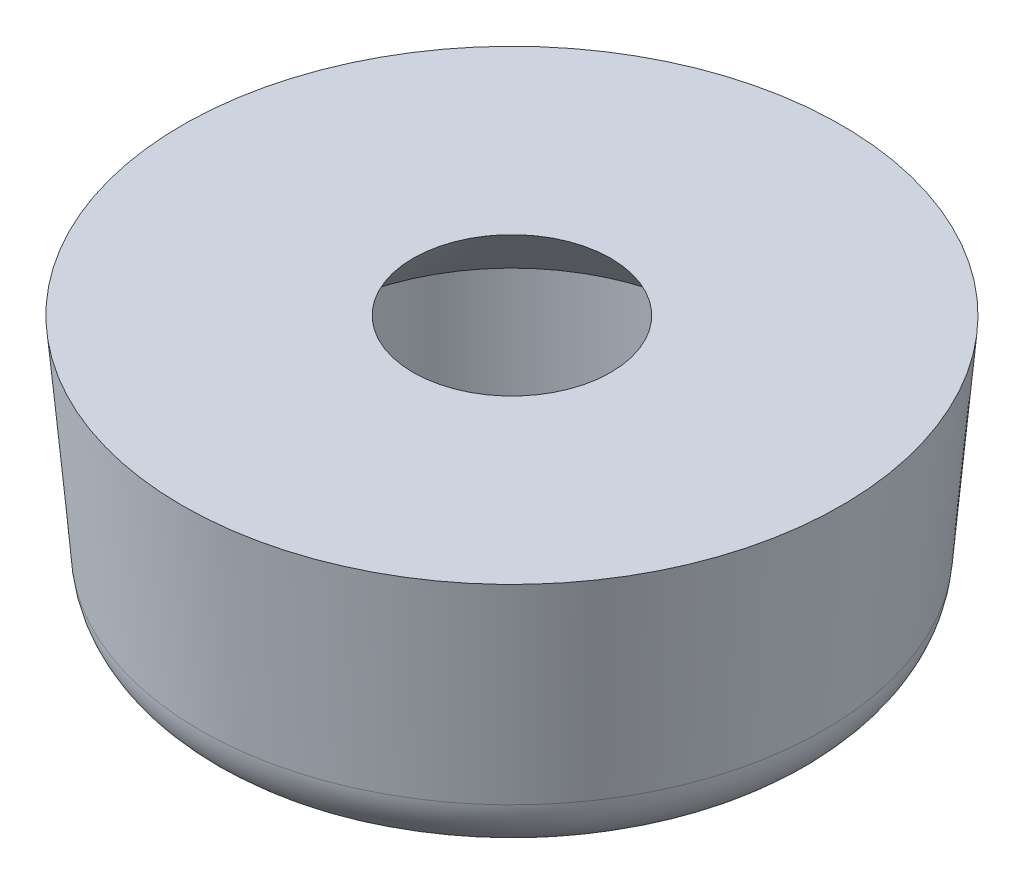
ISO-10303-21;
HEADER;
FILE_DESCRIPTION(('STEP AP214'),'2;1');
FILE_NAME('part.step','',(''),(''),'','','');
FILE_SCHEMA(('AUTOMOTIVE_DESIGN { 1 0 10303 214 1 1 1 1 }'));
ENDSEC;
DATA;
#1=APPLICATION_CONTEXT('core data for automotive mechanical design processes');
#2=APPLICATION_PROTOCOL_DEFINITION('international standard','automotive_design',2000,#1);
#3=PRODUCT_CONTEXT('',#1,'mechanical');
#4=PRODUCT('Part','Part','',(#3));
#5=PRODUCT_RELATED_PRODUCT_CATEGORY('part','',(#4));
#6=PRODUCT_DEFINITION_FORMATION('','',#4);
#7=PRODUCT_DEFINITION_CONTEXT('part definition',#1,'design');
#8=PRODUCT_DEFINITION('design','',#6,#7);
#9=PRODUCT_DEFINITION_SHAPE('','',#8);
#10=(LENGTH_UNIT() NAMED_UNIT(*) SI_UNIT(.MILLI.,.METRE.));
#11=(NAMED_UNIT(*) PLANE_ANGLE_UNIT() SI_UNIT($,.RADIAN.));
#12=(NAMED_UNIT(*) SI_UNIT($,.STERADIAN.) SOLID_ANGLE_UNIT());
#13=UNCERTAINTY_MEASURE_WITH_UNIT(LENGTH_MEASURE(1.E-05),#10,'distance_accuracy_value','');
#14=(GEOMETRIC_REPRESENTATION_CONTEXT(3) GLOBAL_UNCERTAINTY_ASSIGNED_CONTEXT((#13)) GLOBAL_UNIT_ASSIGNED_CONTEXT((#10,
#11,#12)) REPRESENTATION_CONTEXT('',''));
#15=CARTESIAN_POINT('',(0.,0.,0.));
#16=DIRECTION('',(0.,0.,1.));
#17=DIRECTION('',(1.,0.,0.));
#18=AXIS2_PLACEMENT_3D('',#15,#16,#17);
#19=CARTESIAN_POINT('',(0.,4.,0.));
#20=DIRECTION('',(0.,1.,0.));
#21=DIRECTION('',(0.,0.,1.));
#22=AXIS2_PLACEMENT_3D('',#19,#20,#21);
#23=CONICAL_SURFACE('',#22,5.,0.0872664625997167);
#24=CARTESIAN_POINT('',(0.,0.91284425725234,0.));
#25=DIRECTION('',(0.,-1.,0.));
#26=DIRECTION('',(0.,0.,-1.));
#27=AXIS2_PLACEMENT_3D('',#24,#25,#26);
#28=CIRCLE('',#27,4.72990886997063);
#29=CARTESIAN_POINT('',(0.,0.91284425725234,-4.72990886997063));
#30=VERTEX_POINT('',#29);
#31=EDGE_CURVE('E42',#30,#30,#28,.F.);
#32=ORIENTED_EDGE('',*,*,#31,.T.);
#33=EDGE_LOOP('',(#32));
#34=FACE_BOUND('',#33,.T.);
#35=CARTESIAN_POINT('',(0.,4.,0.));
#36=DIRECTION('',(0.,1.,0.));
#37=DIRECTION('',(0.,0.,1.));
#38=AXIS2_PLACEMENT_3D('',#35,#36,#37);
#39=CIRCLE('',#38,5.);
#40=CARTESIAN_POINT('',(0.,4.,5.));
#41=VERTEX_POINT('',#40);
#42=EDGE_CURVE('E46',#41,#41,#39,.T.);
#43=ORIENTED_EDGE('',*,*,#42,.F.);
#44=EDGE_LOOP('',(#43));
#45=FACE_BOUND('',#44,.T.);
#46=ADVANCED_FACE('F31',(#34,#45),#23,.T.);
#47=CARTESIAN_POINT('',(0.,4.,0.));
#48=DIRECTION('',(0.,1.,0.));
#49=DIRECTION('',(0.,0.,1.));
#50=AXIS2_PLACEMENT_3D('',#47,#48,#49);
#51=PLANE('',#50);
#52=CARTESIAN_POINT('',(0.,4.,0.));
#53=DIRECTION('',(0.,1.,0.));
#54=DIRECTION('',(0.,0.,1.));
#55=AXIS2_PLACEMENT_3D('',#52,#53,#54);
#56=CIRCLE('',#55,1.5);
#57=CARTESIAN_POINT('',(0.,4.,1.5));
#58=VERTEX_POINT('',#57);
#59=EDGE_CURVE('E51',#58,#58,#56,.T.);
#60=ORIENTED_EDGE('',*,*,#59,.F.);
#61=EDGE_LOOP('',(#60));
#62=FACE_BOUND('',#61,.T.);
#63=ORIENTED_EDGE('',*,*,#42,.T.);
#64=EDGE_LOOP('',(#63));
#65=FACE_BOUND('',#64,.T.);
#66=ADVANCED_FACE('F62',(#62,#65),#51,.T.);
#67=CARTESIAN_POINT('',(0.,0.,0.));
#68=DIRECTION('',(0.,1.,0.));
#69=DIRECTION('',(0.,0.,1.));
#70=AXIS2_PLACEMENT_3D('',#67,#68,#69);
#71=PLANE('',#70);
#72=CARTESIAN_POINT('',(0.,0.,0.));
#73=DIRECTION('',(0.,1.,0.));
#74=DIRECTION('',(0.,0.,1.));
#75=AXIS2_PLACEMENT_3D('',#72,#73,#74);
#76=CIRCLE('',#75,3.73371417187888);
#77=CARTESIAN_POINT('',(0.,0.,3.73371417187888));
#78=VERTEX_POINT('',#77);
#79=EDGE_CURVE('E38',#78,#78,#76,.F.);
#80=ORIENTED_EDGE('',*,*,#79,.T.);
#81=EDGE_LOOP('',(#80));
#82=FACE_BOUND('',#81,.T.);
#83=CARTESIAN_POINT('',(0.,0.,0.));
#84=DIRECTION('',(0.,-1.,0.));
#85=DIRECTION('',(0.,0.,-1.));
#86=AXIS2_PLACEMENT_3D('',#83,#84,#85);
#87=CIRCLE('',#86,3.);
#88=CARTESIAN_POINT('',(0.,0.,-3.));
#89=VERTEX_POINT('',#88);
#90=EDGE_CURVE('E54',#89,#89,#87,.T.);
#91=ORIENTED_EDGE('',*,*,#90,.F.);
#92=EDGE_LOOP('',(#91));
#93=FACE_BOUND('',#92,.T.);
#94=ADVANCED_FACE('F60',(#82,#93),#71,.F.);
#95=CARTESIAN_POINT('',(0.,2.,0.));
#96=DIRECTION('',(0.,-1.,0.));
#97=DIRECTION('',(0.,0.,-1.));
#98=AXIS2_PLACEMENT_3D('',#95,#96,#97);
#99=CYLINDRICAL_SURFACE('',#98,3.);
#100=CARTESIAN_POINT('',(0.,2.50000000000003,0.));
#101=DIRECTION('',(0.,-1.,0.));
#102=DIRECTION('',(0.,0.,-1.));
#103=AXIS2_PLACEMENT_3D('',#100,#101,#102);
#104=CIRCLE('',#103,3.);
#105=CARTESIAN_POINT('',(0.,2.50000000000003,-3.));
#106=VERTEX_POINT('',#105);
#107=EDGE_CURVE('E10',#106,#106,#104,.F.);
#108=ORIENTED_EDGE('',*,*,#107,.T.);
#109=EDGE_LOOP('',(#108));
#110=FACE_BOUND('',#109,.T.);
#111=ORIENTED_EDGE('',*,*,#90,.T.);
#112=EDGE_LOOP('',(#111));
#113=FACE_BOUND('',#112,.T.);
#114=ADVANCED_FACE('F58',(#110,#113),#99,.F.);
#115=CARTESIAN_POINT('',(0.,1.,0.));
#116=DIRECTION('',(0.,1.,0.));
#117=DIRECTION('',(0.,0.,1.));
#118=AXIS2_PLACEMENT_3D('',#115,#116,#117);
#119=TOROIDAL_SURFACE('',#118,3.73371417187888,1.);
#120=ORIENTED_EDGE('',*,*,#79,.F.);
#121=EDGE_LOOP('',(#120));
#122=FACE_BOUND('',#121,.T.);
#123=ORIENTED_EDGE('',*,*,#31,.F.);
#124=EDGE_LOOP('',(#123));
#125=FACE_BOUND('',#124,.T.);
#126=ADVANCED_FACE('F69',(#122,#125),#119,.T.);
#127=CARTESIAN_POINT('',(0.,2.,0.));
#128=DIRECTION('',(0.,-1.,0.));
#129=DIRECTION('',(0.,0.,-1.));
#130=AXIS2_PLACEMENT_3D('',#127,#128,#129);
#131=CONICAL_SURFACE('',#130,3.50000000000004,0.785398163397453);
#132=ORIENTED_EDGE('',*,*,#59,.T.);
#133=EDGE_LOOP('',(#132));
#134=FACE_BOUND('',#133,.T.);
#135=ORIENTED_EDGE('',*,*,#107,.F.);
#136=EDGE_LOOP('',(#135));
#137=FACE_BOUND('',#136,.T.);
#138=ADVANCED_FACE('F33',(#134,#137),#131,.F.);
#139=CLOSED_SHELL('',(#46,#66,#94,#114,#126,#138));
#140=MANIFOLD_SOLID_BREP('B2',#139);
#141=ADVANCED_BREP_SHAPE_REPRESENTATION('',(#18,#140),#14);
#142=SHAPE_DEFINITION_REPRESENTATION(#9,#141);
ENDSEC;
END-ISO-10303-21;
